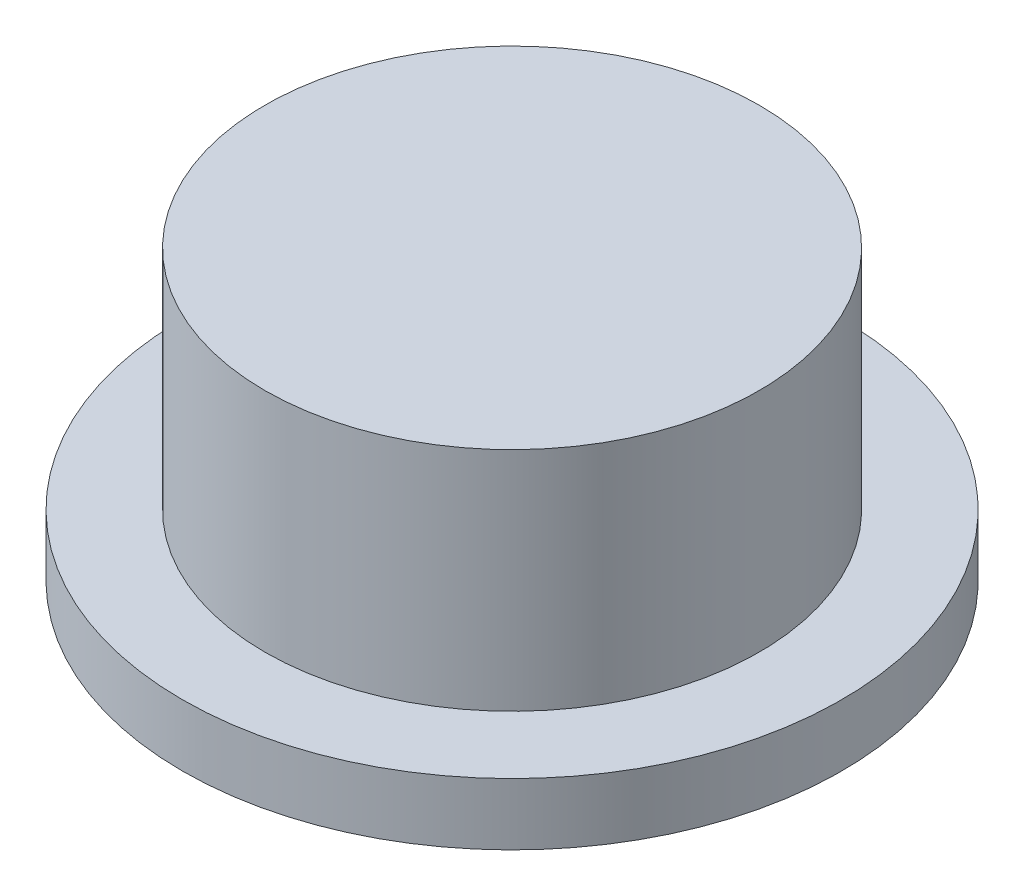
ISO-10303-21;
HEADER;
FILE_DESCRIPTION(('STEP AP214'),'2;1');
FILE_NAME('part.step','',(''),(''),'','','');
FILE_SCHEMA(('AUTOMOTIVE_DESIGN { 1 0 10303 214 1 1 1 1 }'));
ENDSEC;
DATA;
#1=APPLICATION_CONTEXT('core data for automotive mechanical design processes');
#2=APPLICATION_PROTOCOL_DEFINITION('international standard','automotive_design',2000,#1);
#3=PRODUCT_CONTEXT('',#1,'mechanical');
#4=PRODUCT('Part','Part','',(#3));
#5=PRODUCT_RELATED_PRODUCT_CATEGORY('part','',(#4));
#6=PRODUCT_DEFINITION_FORMATION('','',#4);
#7=PRODUCT_DEFINITION_CONTEXT('part definition',#1,'design');
#8=PRODUCT_DEFINITION('design','',#6,#7);
#9=PRODUCT_DEFINITION_SHAPE('','',#8);
#10=(LENGTH_UNIT() NAMED_UNIT(*) SI_UNIT(.MILLI.,.METRE.));
#11=(NAMED_UNIT(*) PLANE_ANGLE_UNIT() SI_UNIT($,.RADIAN.));
#12=(NAMED_UNIT(*) SI_UNIT($,.STERADIAN.) SOLID_ANGLE_UNIT());
#13=UNCERTAINTY_MEASURE_WITH_UNIT(LENGTH_MEASURE(1.E-05),#10,'distance_accuracy_value','');
#14=(GEOMETRIC_REPRESENTATION_CONTEXT(3) GLOBAL_UNCERTAINTY_ASSIGNED_CONTEXT((#13)) GLOBAL_UNIT_ASSIGNED_CONTEXT((#10,
#11,#12)) REPRESENTATION_CONTEXT('',''));
#15=CARTESIAN_POINT('',(0.,0.,0.));
#16=DIRECTION('',(0.,0.,1.));
#17=DIRECTION('',(1.,0.,0.));
#18=AXIS2_PLACEMENT_3D('',#15,#16,#17);
#19=CARTESIAN_POINT('',(0.,0.,0.));
#20=DIRECTION('',(0.,1.,0.));
#21=DIRECTION('',(0.,0.,1.));
#22=AXIS2_PLACEMENT_3D('',#19,#20,#21);
#23=SPHERICAL_SURFACE('',#22,7.9375);
#24=CARTESIAN_POINT('',(0.,-0.937499999999997,0.));
#25=DIRECTION('',(0.,1.,0.));
#26=DIRECTION('',(0.,0.,1.));
#27=AXIS2_PLACEMENT_3D('',#24,#25,#26);
#28=CIRCLE('',#27,7.88194138521723);
#29=CARTESIAN_POINT('',(0.,-0.937499999999996,7.88194138521723));
#30=VERTEX_POINT('',#29);
#31=EDGE_CURVE('E52',#30,#30,#28,.T.);
#32=ORIENTED_EDGE('',*,*,#31,.F.);
#33=EDGE_LOOP('',(#32));
#34=FACE_BOUND('',#33,.T.);
#35=ADVANCED_FACE('F33',(#34),#23,.T.);
#36=CARTESIAN_POINT('',(0.,13.0625,12.));
#37=DIRECTION('',(0.,1.,0.));
#38=DIRECTION('',(0.,0.,1.));
#39=AXIS2_PLACEMENT_3D('',#36,#37,#38);
#40=PLANE('',#39);
#41=CARTESIAN_POINT('',(0.,13.0625,0.));
#42=DIRECTION('',(0.,1.,0.));
#43=DIRECTION('',(0.,0.,1.));
#44=AXIS2_PLACEMENT_3D('',#41,#42,#43);
#45=CIRCLE('',#44,12.);
#46=CARTESIAN_POINT('',(0.,13.0625,12.));
#47=VERTEX_POINT('',#46);
#48=EDGE_CURVE('E10',#47,#47,#45,.T.);
#49=ORIENTED_EDGE('',*,*,#48,.T.);
#50=EDGE_LOOP('',(#49));
#51=FACE_BOUND('',#50,.T.);
#52=ADVANCED_FACE('F60',(#51),#40,.T.);
#53=CARTESIAN_POINT('',(0.,-19.6570059732804,0.));
#54=DIRECTION('',(0.,1.,0.));
#55=DIRECTION('',(0.,0.,1.));
#56=AXIS2_PLACEMENT_3D('',#53,#54,#55);
#57=CYLINDRICAL_SURFACE('',#56,12.);
#58=CARTESIAN_POINT('',(0.,2.0625,0.));
#59=DIRECTION('',(0.,1.,0.));
#60=DIRECTION('',(0.,0.,1.));
#61=AXIS2_PLACEMENT_3D('',#58,#59,#60);
#62=CIRCLE('',#61,12.);
#63=CARTESIAN_POINT('',(0.,2.0625,12.));
#64=VERTEX_POINT('',#63);
#65=EDGE_CURVE('E39',#64,#64,#62,.T.);
#66=ORIENTED_EDGE('',*,*,#65,.T.);
#67=EDGE_LOOP('',(#66));
#68=FACE_BOUND('',#67,.T.);
#69=ORIENTED_EDGE('',*,*,#48,.F.);
#70=EDGE_LOOP('',(#69));
#71=FACE_BOUND('',#70,.T.);
#72=ADVANCED_FACE('F64',(#68,#71),#57,.T.);
#73=CARTESIAN_POINT('',(0.,2.0625,16.));
#74=DIRECTION('',(0.,1.,0.));
#75=DIRECTION('',(0.,0.,1.));
#76=AXIS2_PLACEMENT_3D('',#73,#74,#75);
#77=PLANE('',#76);
#78=CARTESIAN_POINT('',(0.,2.06249999999999,0.));
#79=DIRECTION('',(0.,1.,0.));
#80=DIRECTION('',(0.,0.,1.));
#81=AXIS2_PLACEMENT_3D('',#78,#79,#80);
#82=CIRCLE('',#81,16.);
#83=CARTESIAN_POINT('',(0.,2.0625,16.));
#84=VERTEX_POINT('',#83);
#85=EDGE_CURVE('E43',#84,#84,#82,.T.);
#86=ORIENTED_EDGE('',*,*,#85,.T.);
#87=EDGE_LOOP('',(#86));
#88=FACE_BOUND('',#87,.T.);
#89=ORIENTED_EDGE('',*,*,#65,.F.);
#90=EDGE_LOOP('',(#89));
#91=FACE_BOUND('',#90,.T.);
#92=ADVANCED_FACE('F68',(#88,#91),#77,.T.);
#93=CARTESIAN_POINT('',(0.,-19.6570059732804,0.));
#94=DIRECTION('',(0.,1.,0.));
#95=DIRECTION('',(0.,0.,1.));
#96=AXIS2_PLACEMENT_3D('',#93,#94,#95);
#97=CYLINDRICAL_SURFACE('',#96,16.);
#98=CARTESIAN_POINT('',(0.,-0.937500000000001,0.));
#99=DIRECTION('',(0.,1.,0.));
#100=DIRECTION('',(0.,0.,1.));
#101=AXIS2_PLACEMENT_3D('',#98,#99,#100);
#102=CIRCLE('',#101,16.);
#103=CARTESIAN_POINT('',(0.,-0.937499999999998,16.));
#104=VERTEX_POINT('',#103);
#105=EDGE_CURVE('E47',#104,#104,#102,.T.);
#106=ORIENTED_EDGE('',*,*,#105,.T.);
#107=EDGE_LOOP('',(#106));
#108=FACE_BOUND('',#107,.T.);
#109=ORIENTED_EDGE('',*,*,#85,.F.);
#110=EDGE_LOOP('',(#109));
#111=FACE_BOUND('',#110,.T.);
#112=ADVANCED_FACE('F73',(#108,#111),#97,.T.);
#113=CARTESIAN_POINT('',(0.,-0.9375,7.88194138521723));
#114=DIRECTION('',(0.,-1.,0.));
#115=DIRECTION('',(0.,0.,-1.));
#116=AXIS2_PLACEMENT_3D('',#113,#114,#115);
#117=PLANE('',#116);
#118=ORIENTED_EDGE('',*,*,#31,.T.);
#119=EDGE_LOOP('',(#118));
#120=FACE_BOUND('',#119,.T.);
#121=ORIENTED_EDGE('',*,*,#105,.F.);
#122=EDGE_LOOP('',(#121));
#123=FACE_BOUND('',#122,.T.);
#124=ADVANCED_FACE('F56',(#120,#123),#117,.T.);
#125=CLOSED_SHELL('',(#35,#52,#72,#92,#112,#124));
#126=MANIFOLD_SOLID_BREP('B2',#125);
#127=ADVANCED_BREP_SHAPE_REPRESENTATION('',(#18,#126),#14);
#128=SHAPE_DEFINITION_REPRESENTATION(#9,#127);
ENDSEC;
END-ISO-10303-21;
